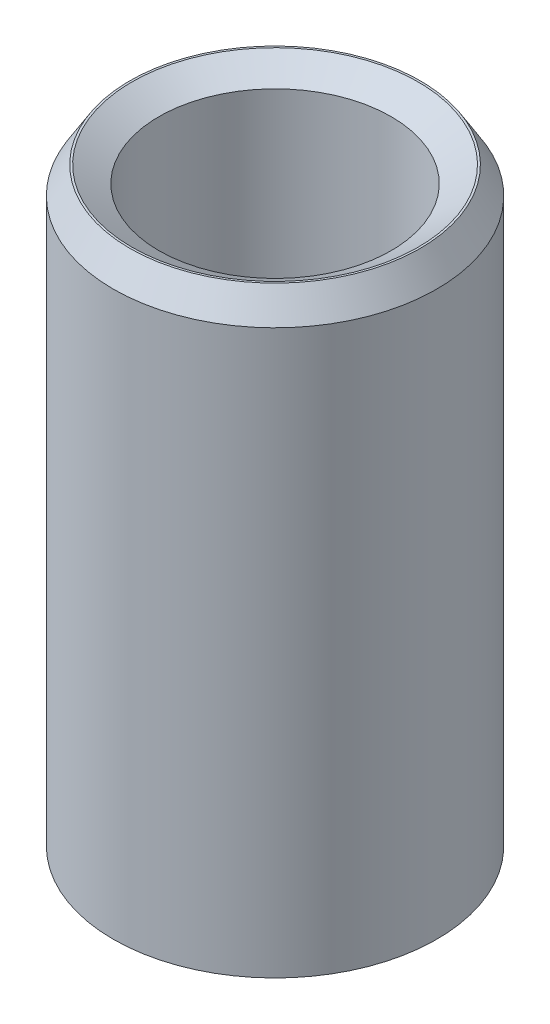
ISO-10303-21;
HEADER;
FILE_DESCRIPTION(('STEP AP214'),'2;1');
FILE_NAME('part.step','',(''),(''),'','','');
FILE_SCHEMA(('AUTOMOTIVE_DESIGN { 1 0 10303 214 1 1 1 1 }'));
ENDSEC;
DATA;
#1=APPLICATION_CONTEXT('core data for automotive mechanical design processes');
#2=APPLICATION_PROTOCOL_DEFINITION('international standard','automotive_design',2000,#1);
#3=PRODUCT_CONTEXT('',#1,'mechanical');
#4=PRODUCT('Part','Part','',(#3));
#5=PRODUCT_RELATED_PRODUCT_CATEGORY('part','',(#4));
#6=PRODUCT_DEFINITION_FORMATION('','',#4);
#7=PRODUCT_DEFINITION_CONTEXT('part definition',#1,'design');
#8=PRODUCT_DEFINITION('design','',#6,#7);
#9=PRODUCT_DEFINITION_SHAPE('','',#8);
#10=(LENGTH_UNIT() NAMED_UNIT(*) SI_UNIT(.MILLI.,.METRE.));
#11=(NAMED_UNIT(*) PLANE_ANGLE_UNIT() SI_UNIT($,.RADIAN.));
#12=(NAMED_UNIT(*) SI_UNIT($,.STERADIAN.) SOLID_ANGLE_UNIT());
#13=UNCERTAINTY_MEASURE_WITH_UNIT(LENGTH_MEASURE(1.E-05),#10,'distance_accuracy_value','');
#14=(GEOMETRIC_REPRESENTATION_CONTEXT(3) GLOBAL_UNCERTAINTY_ASSIGNED_CONTEXT((#13)) GLOBAL_UNIT_ASSIGNED_CONTEXT((#10,
#11,#12)) REPRESENTATION_CONTEXT('',''));
#15=CARTESIAN_POINT('',(0.,0.,0.));
#16=DIRECTION('',(0.,0.,1.));
#17=DIRECTION('',(1.,0.,0.));
#18=AXIS2_PLACEMENT_3D('',#15,#16,#17);
#19=CARTESIAN_POINT('',(0.,56.2601688222677,0.));
#20=DIRECTION('',(0.,-1.,0.));
#21=DIRECTION('',(0.,0.,-1.));
#22=AXIS2_PLACEMENT_3D('',#19,#20,#21);
#23=CYLINDRICAL_SURFACE('',#22,15.);
#24=CARTESIAN_POINT('',(0.,1.53212815686132,0.));
#25=DIRECTION('',(0.,1.,0.));
#26=DIRECTION('',(0.,0.,1.));
#27=AXIS2_PLACEMENT_3D('',#24,#25,#26);
#28=CIRCLE('',#27,15.);
#29=CARTESIAN_POINT('',(0.,1.53212815686132,15.));
#30=VERTEX_POINT('',#29);
#31=EDGE_CURVE('E10',#30,#30,#28,.T.);
#32=ORIENTED_EDGE('',*,*,#31,.T.);
#33=EDGE_LOOP('',(#32));
#34=FACE_BOUND('',#33,.T.);
#35=CARTESIAN_POINT('',(0.,53.7543866170447,0.));
#36=DIRECTION('',(0.,1.,0.));
#37=DIRECTION('',(0.,0.,1.));
#38=AXIS2_PLACEMENT_3D('',#35,#36,#37);
#39=CIRCLE('',#38,15.);
#40=CARTESIAN_POINT('',(0.,53.7543866170447,15.));
#41=VERTEX_POINT('',#40);
#42=EDGE_CURVE('E50',#41,#41,#39,.F.);
#43=ORIENTED_EDGE('',*,*,#42,.T.);
#44=EDGE_LOOP('',(#43));
#45=FACE_BOUND('',#44,.T.);
#46=ADVANCED_FACE('F39',(#34,#45),#23,.T.);
#47=CARTESIAN_POINT('',(0.,56.2601688222677,0.));
#48=DIRECTION('',(0.,1.,0.));
#49=DIRECTION('',(0.,0.,1.));
#50=AXIS2_PLACEMENT_3D('',#47,#48,#49);
#51=PLANE('',#50);
#52=CARTESIAN_POINT('',(0.,56.2601688222677,0.));
#53=DIRECTION('',(0.,1.,0.));
#54=DIRECTION('',(0.,0.,1.));
#55=AXIS2_PLACEMENT_3D('',#52,#53,#54);
#56=CIRCLE('',#55,13.2771973040995);
#57=CARTESIAN_POINT('',(0.,56.2601688222677,13.2771973040995));
#58=VERTEX_POINT('',#57);
#59=EDGE_CURVE('E58',#58,#58,#56,.F.);
#60=ORIENTED_EDGE('',*,*,#59,.T.);
#61=EDGE_LOOP('',(#60));
#62=FACE_BOUND('',#61,.T.);
#63=CARTESIAN_POINT('',(0.,56.2601688222677,0.));
#64=DIRECTION('',(0.,1.,0.));
#65=DIRECTION('',(0.,0.,1.));
#66=AXIS2_PLACEMENT_3D('',#63,#64,#65);
#67=CIRCLE('',#66,13.4678718431387);
#68=CARTESIAN_POINT('',(0.,56.2601688222677,13.4678718431387));
#69=VERTEX_POINT('',#68);
#70=EDGE_CURVE('E61',#69,#69,#67,.T.);
#71=ORIENTED_EDGE('',*,*,#70,.T.);
#72=EDGE_LOOP('',(#71));
#73=FACE_BOUND('',#72,.T.);
#74=ADVANCED_FACE('F88',(#62,#73),#51,.T.);
#75=CARTESIAN_POINT('',(0.,0.,0.));
#76=DIRECTION('',(0.,1.,0.));
#77=DIRECTION('',(0.,0.,1.));
#78=AXIS2_PLACEMENT_3D('',#75,#76,#77);
#79=PLANE('',#78);
#80=CARTESIAN_POINT('',(0.,0.,0.));
#81=DIRECTION('',(0.,1.,0.));
#82=DIRECTION('',(0.,0.,1.));
#83=AXIS2_PLACEMENT_3D('',#80,#81,#82);
#84=CIRCLE('',#83,12.3035432557379);
#85=CARTESIAN_POINT('',(0.,0.,12.3035432557379));
#86=VERTEX_POINT('',#85);
#87=EDGE_CURVE('E51',#86,#86,#84,.T.);
#88=ORIENTED_EDGE('',*,*,#87,.T.);
#89=EDGE_LOOP('',(#88));
#90=FACE_BOUND('',#89,.T.);
#91=CARTESIAN_POINT('',(0.,0.,0.));
#92=DIRECTION('',(0.,1.,0.));
#93=DIRECTION('',(0.,0.,1.));
#94=AXIS2_PLACEMENT_3D('',#91,#92,#93);
#95=CIRCLE('',#94,12.4942177947771);
#96=CARTESIAN_POINT('',(0.,0.,12.4942177947771));
#97=VERTEX_POINT('',#96);
#98=EDGE_CURVE('E54',#97,#97,#95,.F.);
#99=ORIENTED_EDGE('',*,*,#98,.T.);
#100=EDGE_LOOP('',(#99));
#101=FACE_BOUND('',#100,.T.);
#102=ADVANCED_FACE('F83',(#90,#101),#79,.F.);
#103=CARTESIAN_POINT('',(0.,56.2601688222677,0.));
#104=DIRECTION('',(0.,-1.,0.));
#105=DIRECTION('',(0.,0.,-1.));
#106=AXIS2_PLACEMENT_3D('',#103,#104,#105);
#107=CYLINDRICAL_SURFACE('',#106,10.7714150988766);
#108=CARTESIAN_POINT('',(0.,54.7280406654064,0.));
#109=DIRECTION('',(0.,1.,0.));
#110=DIRECTION('',(0.,0.,1.));
#111=AXIS2_PLACEMENT_3D('',#108,#109,#110);
#112=CIRCLE('',#111,10.7714150988766);
#113=CARTESIAN_POINT('',(0.,54.7280406654064,10.7714150988766));
#114=VERTEX_POINT('',#113);
#115=EDGE_CURVE('E67',#114,#114,#112,.T.);
#116=ORIENTED_EDGE('',*,*,#115,.T.);
#117=EDGE_LOOP('',(#116));
#118=FACE_BOUND('',#117,.T.);
#119=CARTESIAN_POINT('',(0.,2.5057822052229,0.));
#120=DIRECTION('',(0.,1.,0.));
#121=DIRECTION('',(0.,0.,1.));
#122=AXIS2_PLACEMENT_3D('',#119,#120,#121);
#123=CIRCLE('',#122,10.7714150988766);
#124=CARTESIAN_POINT('',(0.,2.5057822052229,10.7714150988766));
#125=VERTEX_POINT('',#124);
#126=EDGE_CURVE('E69',#125,#125,#123,.F.);
#127=ORIENTED_EDGE('',*,*,#126,.T.);
#128=EDGE_LOOP('',(#127));
#129=FACE_BOUND('',#128,.T.);
#130=ADVANCED_FACE('F71',(#118,#129),#107,.F.);
#131=CARTESIAN_POINT('',(0.,54.7280406654064,0.));
#132=DIRECTION('',(0.,1.,0.));
#133=DIRECTION('',(0.,0.,1.));
#134=AXIS2_PLACEMENT_3D('',#131,#132,#133);
#135=CONICAL_SURFACE('',#134,10.7714150988766,1.02200962348029);
#136=CARTESIAN_POINT('',(0.,56.2601688222677,13.2771973040995));
#137=CARTESIAN_POINT('',(0.,56.244209153967,13.2510954061284));
#138=CARTESIAN_POINT('',(0.,56.2282494856664,13.2249935081573));
#139=CARTESIAN_POINT('',(0.,56.1963301490651,13.1727897122152));
#140=CARTESIAN_POINT('',(0.,56.1803704807645,13.1466878142441));
#141=CARTESIAN_POINT('',(0.,56.1484511441632,13.094484018302));
#142=CARTESIAN_POINT('',(0.,56.1324914758626,13.0683821203309));
#143=CARTESIAN_POINT('',(0.,56.1005721392613,13.0161783243887));
#144=CARTESIAN_POINT('',(0.,56.0846124709606,12.9900764264177));
#145=CARTESIAN_POINT('',(0.,56.0526931343594,12.9378726304755));
#146=CARTESIAN_POINT('',(0.,56.0367334660587,12.9117707325045));
#147=CARTESIAN_POINT('',(0.,56.0048141294574,12.8595669365623));
#148=CARTESIAN_POINT('',(0.,55.9888544611568,12.8334650385912));
#149=CARTESIAN_POINT('',(0.,55.9569351245555,12.7812612426491));
#150=CARTESIAN_POINT('',(0.,55.9409754562549,12.755159344678));
#151=CARTESIAN_POINT('',(0.,55.9090561196536,12.7029555487359));
#152=CARTESIAN_POINT('',(0.,55.893096451353,12.6768536507648));
#153=CARTESIAN_POINT('',(0.,55.8611771147517,12.6246498548227));
#154=CARTESIAN_POINT('',(0.,55.8452174464511,12.5985479568516));
#155=CARTESIAN_POINT('',(0.,55.8132981098498,12.5463441609094));
#156=CARTESIAN_POINT('',(0.,55.7973384415491,12.5202422629384));
#157=CARTESIAN_POINT('',(0.,55.7654191049479,12.4680384669962));
#158=CARTESIAN_POINT('',(0.,55.7494594366472,12.4419365690252));
#159=CARTESIAN_POINT('',(0.,55.717540100046,12.389732773083));
#160=CARTESIAN_POINT('',(0.,55.7015804317453,12.3636308751119));
#161=CARTESIAN_POINT('',(0.,55.669661095144,12.3114270791698));
#162=CARTESIAN_POINT('',(0.,55.6537014268434,12.2853251811987));
#163=CARTESIAN_POINT('',(0.,55.6217820902421,12.2331213852566));
#164=CARTESIAN_POINT('',(0.,55.6058224219415,12.2070194872855));
#165=CARTESIAN_POINT('',(0.,55.5739030853402,12.1548156913434));
#166=CARTESIAN_POINT('',(0.,55.5579434170396,12.1287137933723));
#167=CARTESIAN_POINT('',(0.,55.5260240804383,12.0765099974302));
#168=CARTESIAN_POINT('',(0.,55.5100644121377,12.0504080994591));
#169=CARTESIAN_POINT('',(0.,55.4781450755364,11.9982043035169));
#170=CARTESIAN_POINT('',(0.,55.4621854072357,11.9721024055459));
#171=CARTESIAN_POINT('',(0.,55.4302660706345,11.9198986096037));
#172=CARTESIAN_POINT('',(0.,55.4143064023338,11.8937967116327));
#173=CARTESIAN_POINT('',(0.,55.3823870657325,11.8415929156905));
#174=CARTESIAN_POINT('',(0.,55.3664273974319,11.8154910177194));
#175=CARTESIAN_POINT('',(0.,55.3345080608306,11.7632872217773));
#176=CARTESIAN_POINT('',(0.,55.31854839253,11.7371853238062));
#177=CARTESIAN_POINT('',(0.,55.2866290559287,11.6849815278641));
#178=CARTESIAN_POINT('',(0.,55.2706693876281,11.658879629893));
#179=CARTESIAN_POINT('',(0.,55.2387500510268,11.6066758339509));
#180=CARTESIAN_POINT('',(0.,55.2227903827262,11.5805739359798));
#181=CARTESIAN_POINT('',(0.,55.1908710461249,11.5283701400376));
#182=CARTESIAN_POINT('',(0.,55.1749113778242,11.5022682420666));
#183=CARTESIAN_POINT('',(0.,55.142992041223,11.4500644461244));
#184=CARTESIAN_POINT('',(0.,55.1270323729223,11.4239625481534));
#185=CARTESIAN_POINT('',(0.,55.0951130363211,11.3717587522112));
#186=CARTESIAN_POINT('',(0.,55.0791533680204,11.3456568542401));
#187=CARTESIAN_POINT('',(0.,55.0472340314191,11.293453058298));
#188=CARTESIAN_POINT('',(0.,55.0312743631185,11.2673511603269));
#189=CARTESIAN_POINT('',(0.,54.9993550265172,11.2151473643848));
#190=CARTESIAN_POINT('',(0.,54.9833953582166,11.1890454664137));
#191=CARTESIAN_POINT('',(0.,54.9514760216153,11.1368416704716));
#192=CARTESIAN_POINT('',(0.,54.9355163533147,11.1107397725005));
#193=CARTESIAN_POINT('',(0.,54.9035970167134,11.0585359765584));
#194=CARTESIAN_POINT('',(0.,54.8876373484128,11.0324340785873));
#195=CARTESIAN_POINT('',(0.,54.8557180118115,10.9802302826451));
#196=CARTESIAN_POINT('',(0.,54.8397583435108,10.9541283846741));
#197=CARTESIAN_POINT('',(0.,54.8078390069096,10.9019245887319));
#198=CARTESIAN_POINT('',(0.,54.7918793386089,10.8758226907608));
#199=CARTESIAN_POINT('',(0.,54.7599600020076,10.8236188948187));
#200=CARTESIAN_POINT('',(0.,54.744000333707,10.7975169968476));
#201=CARTESIAN_POINT('',(0.,54.7280406654064,10.7714150988766));
#202=B_SPLINE_CURVE_WITH_KNOTS('',3,(#136,#137,#138,#139,#140,#141,#142,#143,#144,#145,#146,
#147,#148,#149,#150,#151,#152,#153,#154,#155,#156,#157,#158,#159,#160,#161,#162,#163,#164,#165,
#166,#167,#168,#169,#170,#171,#172,#173,#174,#175,#176,#177,#178,#179,#180,#181,#182,#183,#184,
#185,#186,#187,#188,#189,#190,#191,#192,#193,#194,#195,#196,#197,#198,#199,#200,#201),
.UNSPECIFIED.,.F.,.F.,(4,2,2,2,2,2,2,2,2,2,2,2,2,2,2,2,2,2,2,2,2,2,2,2,2,2,2,2,2,2,2,2,4),(0.,
0.0917833362306451,0.18356667246129,0.275350008691939,0.367133344922584,0.458916681153233,
0.550700017383876,0.642483353614521,0.73426668984517,0.826050026075815,0.917833362306464,
1.00961669853711,1.10140003476775,1.1931833709984,1.28496670722905,1.3767500434597,
1.46853337969034,1.56031671592098,1.65210005215163,1.74388338838228,1.83566672461293,
1.92745006084357,2.01923339707422,2.11101673330486,2.20280006953551,2.29458340576616,
2.3863667419968,2.47815007822745,2.5699334144581,2.66171675068874,2.75350008691939,
2.84528342315003,2.93706675938068),.UNSPECIFIED.);
#203=EDGE_CURVE('BSEAM77',#58,#114,#202,.T.);
#204=ORIENTED_EDGE('',*,*,#59,.F.);
#205=ORIENTED_EDGE('',*,*,#115,.F.);
#206=ORIENTED_EDGE('',*,*,#203,.T.);
#207=ORIENTED_EDGE('',*,*,#203,.F.);
#208=EDGE_LOOP('',(#204,#206,#205,#207));
#209=FACE_BOUND('',#208,.T.);
#210=ADVANCED_FACE('F77',(#209),#135,.F.);
#211=CARTESIAN_POINT('',(0.,0.,0.));
#212=DIRECTION('',(0.,-1.,0.));
#213=DIRECTION('',(0.,0.,-1.));
#214=AXIS2_PLACEMENT_3D('',#211,#212,#213);
#215=CONICAL_SURFACE('',#214,12.3035432557379,0.548786703314611);
#216=ORIENTED_EDGE('',*,*,#126,.F.);
#217=EDGE_LOOP('',(#216));
#218=FACE_BOUND('',#217,.T.);
#219=ORIENTED_EDGE('',*,*,#87,.F.);
#220=EDGE_LOOP('',(#219));
#221=FACE_BOUND('',#220,.T.);
#222=ADVANCED_FACE('F73',(#218,#221),#215,.F.);
#223=CARTESIAN_POINT('',(0.,1.53212815686132,0.));
#224=DIRECTION('',(0.,1.,0.));
#225=DIRECTION('',(0.,0.,1.));
#226=AXIS2_PLACEMENT_3D('',#223,#224,#225);
#227=CONICAL_SURFACE('',#226,15.,1.02200962348029);
#228=CARTESIAN_POINT('',(0.,0.,12.4942177947771));
#229=CARTESIAN_POINT('',(0.,0.0159596683006385,12.5203196927482));
#230=CARTESIAN_POINT('',(0.,0.0319193366012772,12.5464215907192));
#231=CARTESIAN_POINT('',(0.,0.0638386732025546,12.5986253866614));
#232=CARTESIAN_POINT('',(0.,0.0797983415031933,12.6247272846324));
#233=CARTESIAN_POINT('',(0.,0.111717678104471,12.6769310805746));
#234=CARTESIAN_POINT('',(0.,0.127677346405109,12.7030329785457));
#235=CARTESIAN_POINT('',(0.,0.159596683006387,12.7552367744878));
#236=CARTESIAN_POINT('',(0.,0.175556351307026,12.7813386724589));
#237=CARTESIAN_POINT('',(0.,0.207475687908303,12.833542468401));
#238=CARTESIAN_POINT('',(0.,0.223435356208942,12.8596443663721));
#239=CARTESIAN_POINT('',(0.,0.255354692810219,12.9118481623142));
#240=CARTESIAN_POINT('',(0.,0.271314361110858,12.9379500602853));
#241=CARTESIAN_POINT('',(0.,0.303233697712135,12.9901538562275));
#242=CARTESIAN_POINT('',(0.,0.319193366012774,13.0162557541985));
#243=CARTESIAN_POINT('',(0.,0.351112702614052,13.0684595501407));
#244=CARTESIAN_POINT('',(0.,0.36707237091469,13.0945614481117));
#245=CARTESIAN_POINT('',(0.,0.398991707515968,13.1467652440539));
#246=CARTESIAN_POINT('',(0.,0.414951375816606,13.172867142025));
#247=CARTESIAN_POINT('',(0.,0.446870712417884,13.2250709379671));
#248=CARTESIAN_POINT('',(0.,0.462830380718522,13.2511728359382));
#249=CARTESIAN_POINT('',(0.,0.4947497173198,13.3033766318803));
#250=CARTESIAN_POINT('',(0.,0.510709385620439,13.3294785298514));
#251=CARTESIAN_POINT('',(0.,0.542628722221716,13.3816823257935));
#252=CARTESIAN_POINT('',(0.,0.558588390522355,13.4077842237646));
#253=CARTESIAN_POINT('',(0.,0.590507727123632,13.4599880197067));
#254=CARTESIAN_POINT('',(0.,0.606467395424271,13.4860899176778));
#255=CARTESIAN_POINT('',(0.,0.638386732025549,13.53829371362));
#256=CARTESIAN_POINT('',(0.,0.654346400326187,13.564395611591));
#257=CARTESIAN_POINT('',(0.,0.686265736927464,13.6165994075332));
#258=CARTESIAN_POINT('',(0.,0.702225405228103,13.6427013055043));
#259=CARTESIAN_POINT('',(0.,0.734144741829381,13.6949051014464));
#260=CARTESIAN_POINT('',(0.,0.750104410130019,13.7210069994175));
#261=CARTESIAN_POINT('',(0.,0.782023746731297,13.7732107953596));
#262=CARTESIAN_POINT('',(0.,0.797983415031935,13.7993126933307));
#263=CARTESIAN_POINT('',(0.,0.829902751633213,13.8515164892728));
#264=CARTESIAN_POINT('',(0.,0.845862419933852,13.8776183872439));
#265=CARTESIAN_POINT('',(0.,0.877781756535129,13.929822183186));
#266=CARTESIAN_POINT('',(0.,0.893741424835768,13.9559240811571));
#267=CARTESIAN_POINT('',(0.,0.925660761437045,14.0081278770993));
#268=CARTESIAN_POINT('',(0.,0.941620429737684,14.0342297750703));
#269=CARTESIAN_POINT('',(0.,0.973539766338961,14.0864335710125));
#270=CARTESIAN_POINT('',(0.,0.9894994346396,14.1125354689836));
#271=CARTESIAN_POINT('',(0.,1.02141877124088,14.1647392649257));
#272=CARTESIAN_POINT('',(0.,1.03737843954152,14.1908411628968));
#273=CARTESIAN_POINT('',(0.,1.06929777614279,14.2430449588389));
#274=CARTESIAN_POINT('',(0.,1.08525744444343,14.26914685681));
#275=CARTESIAN_POINT('',(0.,1.11717678104471,14.3213506527521));
#276=CARTESIAN_POINT('',(0.,1.13313644934535,14.3474525507232));
#277=CARTESIAN_POINT('',(0.,1.16505578594663,14.3996563466653));
#278=CARTESIAN_POINT('',(0.,1.18101545424726,14.4257582446364));
#279=CARTESIAN_POINT('',(0.,1.21293479084854,14.4779620405786));
#280=CARTESIAN_POINT('',(0.,1.22889445914918,14.5040639385496));
#281=CARTESIAN_POINT('',(0.,1.26081379575046,14.5562677344918));
#282=CARTESIAN_POINT('',(0.,1.2767734640511,14.5823696324628));
#283=CARTESIAN_POINT('',(0.,1.30869280065237,14.634573428405));
#284=CARTESIAN_POINT('',(0.,1.32465246895301,14.6606753263761));
#285=CARTESIAN_POINT('',(0.,1.35657180555429,14.7128791223182));
#286=CARTESIAN_POINT('',(0.,1.37253147385493,14.7389810202893));
#287=CARTESIAN_POINT('',(0.,1.40445081045621,14.7911848162314));
#288=CARTESIAN_POINT('',(0.,1.42041047875685,14.8172867142025));
#289=CARTESIAN_POINT('',(0.,1.45232981535812,14.8694905101446));
#290=CARTESIAN_POINT('',(0.,1.46828948365876,14.8955924081157));
#291=CARTESIAN_POINT('',(0.,1.50020882026004,14.9477962040579));
#292=CARTESIAN_POINT('',(0.,1.51616848856068,14.9738981020289));
#293=CARTESIAN_POINT('',(0.,1.53212815686132,15.));
#294=B_SPLINE_CURVE_WITH_KNOTS('',3,(#228,#229,#230,#231,#232,#233,#234,#235,#236,#237,#238,
#239,#240,#241,#242,#243,#244,#245,#246,#247,#248,#249,#250,#251,#252,#253,#254,#255,#256,#257,
#258,#259,#260,#261,#262,#263,#264,#265,#266,#267,#268,#269,#270,#271,#272,#273,#274,#275,#276,
#277,#278,#279,#280,#281,#282,#283,#284,#285,#286,#287,#288,#289,#290,#291,#292,#293),
.UNSPECIFIED.,.F.,.F.,(4,2,2,2,2,2,2,2,2,2,2,2,2,2,2,2,2,2,2,2,2,2,2,2,2,2,2,2,2,2,2,2,4),(0.,
0.0917833362306468,0.183566672461294,0.27535000869194,0.367133344922587,0.458916681153234,
0.550700017383881,0.642483353614527,0.734266689845174,0.826050026075822,0.917833362306469,
1.00961669853712,1.10140003476776,1.19318337099841,1.28496670722906,1.3767500434597,
1.46853337969035,1.560316715921,1.65210005215165,1.74388338838229,1.83566672461294,
1.92745006084359,2.01923339707423,2.11101673330488,2.20280006953553,2.29458340576617,
2.38636674199682,2.47815007822747,2.56993341445812,2.66171675068876,2.75350008691941,
2.84528342315006,2.9370667593807),.UNSPECIFIED.);
#295=EDGE_CURVE('BSEAM76',#97,#30,#294,.T.);
#296=ORIENTED_EDGE('',*,*,#98,.F.);
#297=ORIENTED_EDGE('',*,*,#31,.F.);
#298=ORIENTED_EDGE('',*,*,#295,.T.);
#299=ORIENTED_EDGE('',*,*,#295,.F.);
#300=EDGE_LOOP('',(#296,#298,#297,#299));
#301=FACE_BOUND('',#300,.T.);
#302=ADVANCED_FACE('F76',(#301),#227,.T.);
#303=CARTESIAN_POINT('',(0.,56.2601688222677,0.));
#304=DIRECTION('',(0.,-1.,0.));
#305=DIRECTION('',(0.,0.,-1.));
#306=AXIS2_PLACEMENT_3D('',#303,#304,#305);
#307=CONICAL_SURFACE('',#306,13.4678718431387,0.54878670331461);
#308=ORIENTED_EDGE('',*,*,#42,.F.);
#309=EDGE_LOOP('',(#308));
#310=FACE_BOUND('',#309,.T.);
#311=ORIENTED_EDGE('',*,*,#70,.F.);
#312=EDGE_LOOP('',(#311));
#313=FACE_BOUND('',#312,.T.);
#314=ADVANCED_FACE('F45',(#310,#313),#307,.T.);
#315=CLOSED_SHELL('',(#46,#74,#102,#130,#210,#222,#302,#314));
#316=MANIFOLD_SOLID_BREP('B2',#315);
#317=ADVANCED_BREP_SHAPE_REPRESENTATION('',(#18,#316),#14);
#318=SHAPE_DEFINITION_REPRESENTATION(#9,#317);
ENDSEC;
END-ISO-10303-21;
